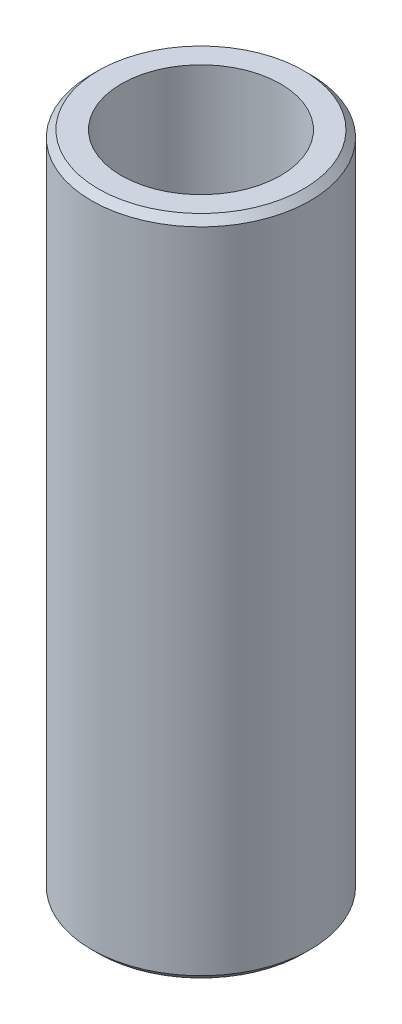
ISO-10303-21;
HEADER;
FILE_DESCRIPTION(('STEP AP214'),'2;1');
FILE_NAME('part.step','',(''),(''),'','','');
FILE_SCHEMA(('AUTOMOTIVE_DESIGN { 1 0 10303 214 1 1 1 1 }'));
ENDSEC;
DATA;
#1=APPLICATION_CONTEXT('core data for automotive mechanical design processes');
#2=APPLICATION_PROTOCOL_DEFINITION('international standard','automotive_design',2000,#1);
#3=PRODUCT_CONTEXT('',#1,'mechanical');
#4=PRODUCT('Part','Part','',(#3));
#5=PRODUCT_RELATED_PRODUCT_CATEGORY('part','',(#4));
#6=PRODUCT_DEFINITION_FORMATION('','',#4);
#7=PRODUCT_DEFINITION_CONTEXT('part definition',#1,'design');
#8=PRODUCT_DEFINITION('design','',#6,#7);
#9=PRODUCT_DEFINITION_SHAPE('','',#8);
#10=(LENGTH_UNIT() NAMED_UNIT(*) SI_UNIT(.MILLI.,.METRE.));
#11=(NAMED_UNIT(*) PLANE_ANGLE_UNIT() SI_UNIT($,.RADIAN.));
#12=(NAMED_UNIT(*) SI_UNIT($,.STERADIAN.) SOLID_ANGLE_UNIT());
#13=UNCERTAINTY_MEASURE_WITH_UNIT(LENGTH_MEASURE(1.E-05),#10,'distance_accuracy_value','');
#14=(GEOMETRIC_REPRESENTATION_CONTEXT(3) GLOBAL_UNCERTAINTY_ASSIGNED_CONTEXT((#13)) GLOBAL_UNIT_ASSIGNED_CONTEXT((#10,
#11,#12)) REPRESENTATION_CONTEXT('',''));
#15=CARTESIAN_POINT('',(0.,0.,0.));
#16=DIRECTION('',(0.,0.,1.));
#17=DIRECTION('',(1.,0.,0.));
#18=AXIS2_PLACEMENT_3D('',#15,#16,#17);
#19=CARTESIAN_POINT('',(0.,287.57751301982,0.));
#20=DIRECTION('',(0.,-1.,0.));
#21=DIRECTION('',(0.,0.,-1.));
#22=AXIS2_PLACEMENT_3D('',#19,#20,#21);
#23=CYLINDRICAL_SURFACE('',#22,47.5);
#24=CARTESIAN_POINT('',(0.,284.620875226847,0.));
#25=DIRECTION('',(0.,1.,0.));
#26=DIRECTION('',(0.,0.,1.));
#27=AXIS2_PLACEMENT_3D('',#24,#25,#26);
#28=CIRCLE('',#27,47.5);
#29=CARTESIAN_POINT('',(0.,284.620875226847,47.5));
#30=VERTEX_POINT('',#29);
#31=EDGE_CURVE('E50',#30,#30,#28,.F.);
#32=ORIENTED_EDGE('',*,*,#31,.T.);
#33=EDGE_LOOP('',(#32));
#34=FACE_BOUND('',#33,.T.);
#35=CARTESIAN_POINT('',(0.,2.95663779297262,0.));
#36=DIRECTION('',(0.,1.,0.));
#37=DIRECTION('',(0.,0.,1.));
#38=AXIS2_PLACEMENT_3D('',#35,#36,#37);
#39=CIRCLE('',#38,47.5);
#40=CARTESIAN_POINT('',(0.,2.95663779297262,47.5));
#41=VERTEX_POINT('',#40);
#42=EDGE_CURVE('E51',#41,#41,#39,.T.);
#43=ORIENTED_EDGE('',*,*,#42,.T.);
#44=EDGE_LOOP('',(#43));
#45=FACE_BOUND('',#44,.T.);
#46=ADVANCED_FACE('F39',(#34,#45),#23,.T.);
#47=CARTESIAN_POINT('',(0.,287.57751301982,0.));
#48=DIRECTION('',(0.,1.,0.));
#49=DIRECTION('',(0.,0.,1.));
#50=AXIS2_PLACEMENT_3D('',#47,#48,#49);
#51=PLANE('',#50);
#52=CARTESIAN_POINT('',(0.,287.57751301982,0.));
#53=DIRECTION('',(0.,1.,0.));
#54=DIRECTION('',(0.,0.,1.));
#55=AXIS2_PLACEMENT_3D('',#52,#53,#54);
#56=CIRCLE('',#55,44.5433622070275);
#57=CARTESIAN_POINT('',(0.,287.57751301982,44.5433622070275));
#58=VERTEX_POINT('',#57);
#59=EDGE_CURVE('E54',#58,#58,#56,.T.);
#60=ORIENTED_EDGE('',*,*,#59,.T.);
#61=EDGE_LOOP('',(#60));
#62=FACE_BOUND('',#61,.T.);
#63=CARTESIAN_POINT('',(0.,287.57751301982,0.));
#64=DIRECTION('',(0.,1.,0.));
#65=DIRECTION('',(0.,0.,1.));
#66=AXIS2_PLACEMENT_3D('',#63,#64,#65);
#67=CIRCLE('',#66,34.5572799200808);
#68=CARTESIAN_POINT('',(0.,287.57751301982,34.5572799200808));
#69=VERTEX_POINT('',#68);
#70=EDGE_CURVE('E58',#69,#69,#67,.T.);
#71=ORIENTED_EDGE('',*,*,#70,.F.);
#72=EDGE_LOOP('',(#71));
#73=FACE_BOUND('',#72,.T.);
#74=ADVANCED_FACE('F69',(#62,#73),#51,.T.);
#75=CARTESIAN_POINT('',(0.,0.,0.));
#76=DIRECTION('',(0.,1.,0.));
#77=DIRECTION('',(0.,0.,1.));
#78=AXIS2_PLACEMENT_3D('',#75,#76,#77);
#79=PLANE('',#78);
#80=CARTESIAN_POINT('',(0.,0.,0.));
#81=DIRECTION('',(0.,1.,0.));
#82=DIRECTION('',(0.,0.,1.));
#83=AXIS2_PLACEMENT_3D('',#80,#81,#82);
#84=CIRCLE('',#83,44.5433622070273);
#85=CARTESIAN_POINT('',(0.,0.,44.5433622070273));
#86=VERTEX_POINT('',#85);
#87=EDGE_CURVE('E10',#86,#86,#84,.F.);
#88=ORIENTED_EDGE('',*,*,#87,.T.);
#89=EDGE_LOOP('',(#88));
#90=FACE_BOUND('',#89,.T.);
#91=CARTESIAN_POINT('',(0.,0.,0.));
#92=DIRECTION('',(0.,1.,0.));
#93=DIRECTION('',(0.,0.,1.));
#94=AXIS2_PLACEMENT_3D('',#91,#92,#93);
#95=CIRCLE('',#94,34.5572799200808);
#96=CARTESIAN_POINT('',(0.,0.,34.5572799200808));
#97=VERTEX_POINT('',#96);
#98=EDGE_CURVE('E63',#97,#97,#95,.T.);
#99=ORIENTED_EDGE('',*,*,#98,.T.);
#100=EDGE_LOOP('',(#99));
#101=FACE_BOUND('',#100,.T.);
#102=ADVANCED_FACE('F75',(#90,#101),#79,.F.);
#103=CARTESIAN_POINT('',(0.,287.57751301982,0.));
#104=DIRECTION('',(0.,-1.,0.));
#105=DIRECTION('',(0.,0.,-1.));
#106=AXIS2_PLACEMENT_3D('',#103,#104,#105);
#107=CYLINDRICAL_SURFACE('',#106,34.5572799200808);
#108=ORIENTED_EDGE('',*,*,#70,.T.);
#109=EDGE_LOOP('',(#108));
#110=FACE_BOUND('',#109,.T.);
#111=ORIENTED_EDGE('',*,*,#98,.F.);
#112=EDGE_LOOP('',(#111));
#113=FACE_BOUND('',#112,.T.);
#114=ADVANCED_FACE('F70',(#110,#113),#107,.F.);
#115=CARTESIAN_POINT('',(0.,287.57751301982,0.));
#116=DIRECTION('',(0.,-1.,0.));
#117=DIRECTION('',(0.,0.,-1.));
#118=AXIS2_PLACEMENT_3D('',#115,#116,#117);
#119=CONICAL_SURFACE('',#118,44.5433622070275,0.785398163397457);
#120=ORIENTED_EDGE('',*,*,#31,.F.);
#121=EDGE_LOOP('',(#120));
#122=FACE_BOUND('',#121,.T.);
#123=ORIENTED_EDGE('',*,*,#59,.F.);
#124=EDGE_LOOP('',(#123));
#125=FACE_BOUND('',#124,.T.);
#126=ADVANCED_FACE('F81',(#122,#125),#119,.T.);
#127=CARTESIAN_POINT('',(0.,2.95663779297262,0.));
#128=DIRECTION('',(0.,1.,0.));
#129=DIRECTION('',(0.,0.,1.));
#130=AXIS2_PLACEMENT_3D('',#127,#128,#129);
#131=CONICAL_SURFACE('',#130,47.5,0.785398163397457);
#132=ORIENTED_EDGE('',*,*,#87,.F.);
#133=EDGE_LOOP('',(#132));
#134=FACE_BOUND('',#133,.T.);
#135=ORIENTED_EDGE('',*,*,#42,.F.);
#136=EDGE_LOOP('',(#135));
#137=FACE_BOUND('',#136,.T.);
#138=ADVANCED_FACE('F45',(#134,#137),#131,.T.);
#139=CLOSED_SHELL('',(#46,#74,#102,#114,#126,#138));
#140=MANIFOLD_SOLID_BREP('B2',#139);
#141=ADVANCED_BREP_SHAPE_REPRESENTATION('',(#18,#140),#14);
#142=SHAPE_DEFINITION_REPRESENTATION(#9,#141);
ENDSEC;
END-ISO-10303-21;
